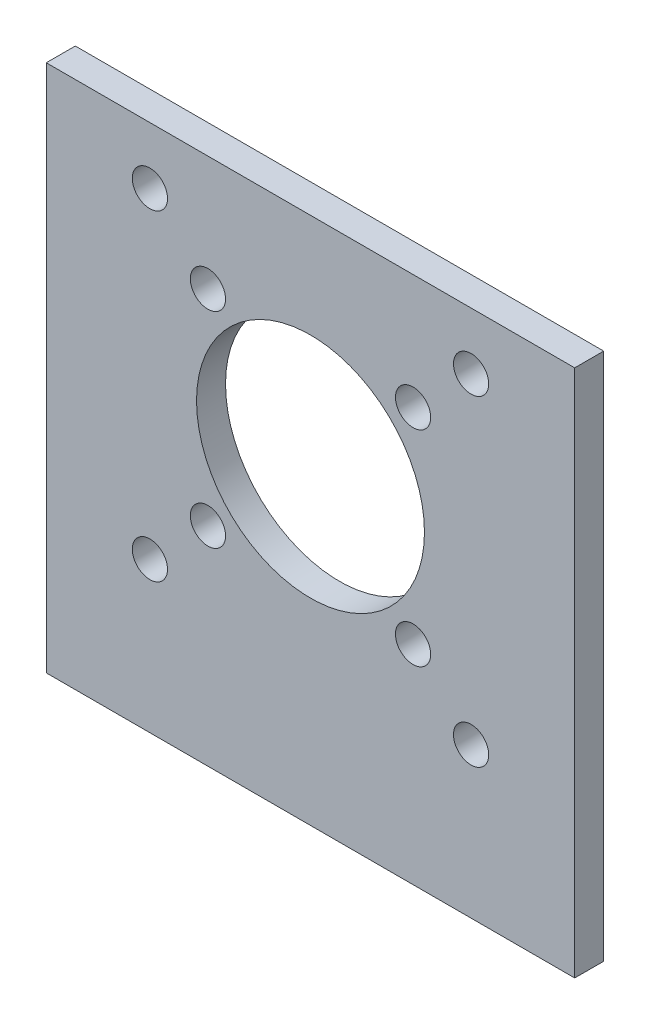
ISO-10303-21;
HEADER;
FILE_DESCRIPTION(('STEP AP214'),'2;1');
FILE_NAME('part.step','',(''),(''),'','','');
FILE_SCHEMA(('AUTOMOTIVE_DESIGN { 1 0 10303 214 1 1 1 1 }'));
ENDSEC;
DATA;
#1=APPLICATION_CONTEXT('core data for automotive mechanical design processes');
#2=APPLICATION_PROTOCOL_DEFINITION('international standard','automotive_design',2000,#1);
#3=PRODUCT_CONTEXT('',#1,'mechanical');
#4=PRODUCT('Part','Part','',(#3));
#5=PRODUCT_RELATED_PRODUCT_CATEGORY('part','',(#4));
#6=PRODUCT_DEFINITION_FORMATION('','',#4);
#7=PRODUCT_DEFINITION_CONTEXT('part definition',#1,'design');
#8=PRODUCT_DEFINITION('design','',#6,#7);
#9=PRODUCT_DEFINITION_SHAPE('','',#8);
#10=(LENGTH_UNIT() NAMED_UNIT(*) SI_UNIT(.MILLI.,.METRE.));
#11=(NAMED_UNIT(*) PLANE_ANGLE_UNIT() SI_UNIT($,.RADIAN.));
#12=(NAMED_UNIT(*) SI_UNIT($,.STERADIAN.) SOLID_ANGLE_UNIT());
#13=UNCERTAINTY_MEASURE_WITH_UNIT(LENGTH_MEASURE(1.E-05),#10,'distance_accuracy_value','');
#14=(GEOMETRIC_REPRESENTATION_CONTEXT(3) GLOBAL_UNCERTAINTY_ASSIGNED_CONTEXT((#13)) GLOBAL_UNIT_ASSIGNED_CONTEXT((#10,
#11,#12)) REPRESENTATION_CONTEXT('',''));
#15=CARTESIAN_POINT('',(0.,0.,0.));
#16=DIRECTION('',(0.,0.,1.));
#17=DIRECTION('',(1.,0.,0.));
#18=AXIS2_PLACEMENT_3D('',#15,#16,#17);
#19=CARTESIAN_POINT('',(25.5,25.5,2.8));
#20=DIRECTION('',(-1.,0.,0.));
#21=DIRECTION('',(0.,-1.,0.));
#22=AXIS2_PLACEMENT_3D('',#19,#20,#21);
#23=PLANE('',#22);
#24=DIRECTION('',(0.,1.,0.));
#25=VECTOR('',#24,1.);
#26=CARTESIAN_POINT('',(25.5,25.5,0.));
#27=LINE('',#26,#25);
#28=CARTESIAN_POINT('',(25.5,-25.5,0.));
#29=VERTEX_POINT('',#28);
#30=CARTESIAN_POINT('',(25.5,25.5,0.));
#31=VERTEX_POINT('',#30);
#32=EDGE_CURVE('E129',#29,#31,#27,.T.);
#33=ORIENTED_EDGE('',*,*,#32,.T.);
#34=DIRECTION('',(0.,0.,-1.));
#35=VECTOR('',#34,1.);
#36=CARTESIAN_POINT('',(25.5,25.5,2.8));
#37=LINE('',#36,#35);
#38=CARTESIAN_POINT('',(25.5,25.5,2.8));
#39=VERTEX_POINT('',#38);
#40=EDGE_CURVE('E12',#39,#31,#37,.T.);
#41=ORIENTED_EDGE('',*,*,#40,.F.);
#42=DIRECTION('',(0.,1.,0.));
#43=VECTOR('',#42,1.);
#44=CARTESIAN_POINT('',(25.5,25.5,2.8));
#45=LINE('',#44,#43);
#46=CARTESIAN_POINT('',(25.5,-25.5,2.8));
#47=VERTEX_POINT('',#46);
#48=EDGE_CURVE('E112',#47,#39,#45,.T.);
#49=ORIENTED_EDGE('',*,*,#48,.F.);
#50=DIRECTION('',(0.,0.,-1.));
#51=VECTOR('',#50,1.);
#52=CARTESIAN_POINT('',(25.5,-25.5,2.8));
#53=LINE('',#52,#51);
#54=EDGE_CURVE('E125',#47,#29,#53,.T.);
#55=ORIENTED_EDGE('',*,*,#54,.T.);
#56=EDGE_LOOP('',(#33,#41,#49,#55));
#57=FACE_BOUND('',#56,.T.);
#58=ADVANCED_FACE('F60',(#57),#23,.F.);
#59=CARTESIAN_POINT('',(-25.5,25.5,2.8));
#60=DIRECTION('',(0.,-1.,0.));
#61=DIRECTION('',(0.,0.,-1.));
#62=AXIS2_PLACEMENT_3D('',#59,#60,#61);
#63=PLANE('',#62);
#64=DIRECTION('',(-1.,0.,0.));
#65=VECTOR('',#64,1.);
#66=CARTESIAN_POINT('',(-25.5,25.5,0.));
#67=LINE('',#66,#65);
#68=CARTESIAN_POINT('',(-25.5,25.5,0.));
#69=VERTEX_POINT('',#68);
#70=EDGE_CURVE('E117',#31,#69,#67,.T.);
#71=ORIENTED_EDGE('',*,*,#70,.T.);
#72=DIRECTION('',(0.,0.,-1.));
#73=VECTOR('',#72,1.);
#74=CARTESIAN_POINT('',(-25.5,25.5,2.8));
#75=LINE('',#74,#73);
#76=CARTESIAN_POINT('',(-25.5,25.5,2.8));
#77=VERTEX_POINT('',#76);
#78=EDGE_CURVE('E69',#77,#69,#75,.T.);
#79=ORIENTED_EDGE('',*,*,#78,.F.);
#80=DIRECTION('',(-1.,0.,0.));
#81=VECTOR('',#80,1.);
#82=CARTESIAN_POINT('',(-25.5,25.5,2.8));
#83=LINE('',#82,#81);
#84=EDGE_CURVE('E107',#39,#77,#83,.T.);
#85=ORIENTED_EDGE('',*,*,#84,.F.);
#86=ORIENTED_EDGE('',*,*,#40,.T.);
#87=EDGE_LOOP('',(#71,#79,#85,#86));
#88=FACE_BOUND('',#87,.T.);
#89=ADVANCED_FACE('F116',(#88),#63,.F.);
#90=CARTESIAN_POINT('',(-25.5,25.5,2.8));
#91=DIRECTION('',(1.,0.,0.));
#92=DIRECTION('',(0.,1.,0.));
#93=AXIS2_PLACEMENT_3D('',#90,#91,#92);
#94=PLANE('',#93);
#95=DIRECTION('',(0.,-1.,0.));
#96=VECTOR('',#95,1.);
#97=CARTESIAN_POINT('',(-25.5,25.5,0.));
#98=LINE('',#97,#96);
#99=CARTESIAN_POINT('',(-25.5,-25.5,0.));
#100=VERTEX_POINT('',#99);
#101=EDGE_CURVE('E94',#69,#100,#98,.T.);
#102=ORIENTED_EDGE('',*,*,#101,.T.);
#103=DIRECTION('',(0.,0.,-1.));
#104=VECTOR('',#103,1.);
#105=CARTESIAN_POINT('',(-25.5,-25.5,2.8));
#106=LINE('',#105,#104);
#107=CARTESIAN_POINT('',(-25.5,-25.5,2.8));
#108=VERTEX_POINT('',#107);
#109=EDGE_CURVE('E119',#108,#100,#106,.T.);
#110=ORIENTED_EDGE('',*,*,#109,.F.);
#111=DIRECTION('',(0.,-1.,0.));
#112=VECTOR('',#111,1.);
#113=CARTESIAN_POINT('',(-25.5,25.5,2.8));
#114=LINE('',#113,#112);
#115=EDGE_CURVE('E110',#77,#108,#114,.T.);
#116=ORIENTED_EDGE('',*,*,#115,.F.);
#117=ORIENTED_EDGE('',*,*,#78,.T.);
#118=EDGE_LOOP('',(#102,#110,#116,#117));
#119=FACE_BOUND('',#118,.T.);
#120=ADVANCED_FACE('F120',(#119),#94,.F.);
#121=CARTESIAN_POINT('',(-25.5,-25.5,2.8));
#122=DIRECTION('',(0.,1.,0.));
#123=DIRECTION('',(0.,0.,1.));
#124=AXIS2_PLACEMENT_3D('',#121,#122,#123);
#125=PLANE('',#124);
#126=DIRECTION('',(1.,0.,0.));
#127=VECTOR('',#126,1.);
#128=CARTESIAN_POINT('',(-25.5,-25.5,0.));
#129=LINE('',#128,#127);
#130=EDGE_CURVE('E100',#100,#29,#129,.T.);
#131=ORIENTED_EDGE('',*,*,#130,.T.);
#132=ORIENTED_EDGE('',*,*,#54,.F.);
#133=DIRECTION('',(1.,0.,0.));
#134=VECTOR('',#133,1.);
#135=CARTESIAN_POINT('',(-25.5,-25.5,2.8));
#136=LINE('',#135,#134);
#137=EDGE_CURVE('E77',#108,#47,#136,.T.);
#138=ORIENTED_EDGE('',*,*,#137,.F.);
#139=ORIENTED_EDGE('',*,*,#109,.T.);
#140=EDGE_LOOP('',(#131,#132,#138,#139));
#141=FACE_BOUND('',#140,.T.);
#142=ADVANCED_FACE('F144',(#141),#125,.F.);
#143=CARTESIAN_POINT('',(0.,0.,2.8));
#144=DIRECTION('',(0.,0.,1.));
#145=DIRECTION('',(1.,0.,0.));
#146=AXIS2_PLACEMENT_3D('',#143,#144,#145);
#147=PLANE('',#146);
#148=CARTESIAN_POINT('',(15.5,20.,2.8));
#149=DIRECTION('',(0.,0.,-1.));
#150=DIRECTION('',(-1.,0.,0.));
#151=AXIS2_PLACEMENT_3D('',#148,#149,#150);
#152=CIRCLE('',#151,1.7);
#153=CARTESIAN_POINT('',(13.8,20.,2.8));
#154=VERTEX_POINT('',#153);
#155=EDGE_CURVE('E185',#154,#154,#152,.T.);
#156=ORIENTED_EDGE('',*,*,#155,.T.);
#157=EDGE_LOOP('',(#156));
#158=FACE_BOUND('',#157,.T.);
#159=CARTESIAN_POINT('',(15.5,-11.,2.8));
#160=DIRECTION('',(0.,0.,-1.));
#161=DIRECTION('',(-1.,0.,0.));
#162=AXIS2_PLACEMENT_3D('',#159,#160,#161);
#163=CIRCLE('',#162,1.7);
#164=CARTESIAN_POINT('',(13.8,-11.,2.8));
#165=VERTEX_POINT('',#164);
#166=EDGE_CURVE('E177',#165,#165,#163,.T.);
#167=ORIENTED_EDGE('',*,*,#166,.T.);
#168=EDGE_LOOP('',(#167));
#169=FACE_BOUND('',#168,.T.);
#170=CARTESIAN_POINT('',(-15.5,-11.,2.8));
#171=DIRECTION('',(0.,0.,-1.));
#172=DIRECTION('',(-1.,0.,0.));
#173=AXIS2_PLACEMENT_3D('',#170,#171,#172);
#174=CIRCLE('',#173,1.7);
#175=CARTESIAN_POINT('',(-17.2,-11.,2.8));
#176=VERTEX_POINT('',#175);
#177=EDGE_CURVE('E169',#176,#176,#174,.T.);
#178=ORIENTED_EDGE('',*,*,#177,.T.);
#179=EDGE_LOOP('',(#178));
#180=FACE_BOUND('',#179,.T.);
#181=CARTESIAN_POINT('',(-15.5,20.,2.8));
#182=DIRECTION('',(0.,0.,-1.));
#183=DIRECTION('',(-1.,0.,0.));
#184=AXIS2_PLACEMENT_3D('',#181,#182,#183);
#185=CIRCLE('',#184,1.7);
#186=CARTESIAN_POINT('',(-17.2,20.,2.8));
#187=VERTEX_POINT('',#186);
#188=EDGE_CURVE('E160',#187,#187,#185,.T.);
#189=ORIENTED_EDGE('',*,*,#188,.T.);
#190=EDGE_LOOP('',(#189));
#191=FACE_BOUND('',#190,.T.);
#192=CARTESIAN_POINT('',(-9.89949493661167,14.3994949366117,2.8));
#193=DIRECTION('',(0.,0.,-1.));
#194=DIRECTION('',(-1.,0.,0.));
#195=AXIS2_PLACEMENT_3D('',#192,#193,#194);
#196=CIRCLE('',#195,1.7);
#197=CARTESIAN_POINT('',(-11.5994949366117,14.3994949366117,2.8));
#198=VERTEX_POINT('',#197);
#199=EDGE_CURVE('E216',#198,#198,#196,.T.);
#200=ORIENTED_EDGE('',*,*,#199,.T.);
#201=EDGE_LOOP('',(#200));
#202=FACE_BOUND('',#201,.T.);
#203=CARTESIAN_POINT('',(9.89949493661167,14.3994949366117,2.8));
#204=DIRECTION('',(0.,0.,-1.));
#205=DIRECTION('',(-1.,0.,0.));
#206=AXIS2_PLACEMENT_3D('',#203,#204,#205);
#207=CIRCLE('',#206,1.7);
#208=CARTESIAN_POINT('',(8.19949493661167,14.3994949366117,2.8));
#209=VERTEX_POINT('',#208);
#210=EDGE_CURVE('E208',#209,#209,#207,.T.);
#211=ORIENTED_EDGE('',*,*,#210,.T.);
#212=EDGE_LOOP('',(#211));
#213=FACE_BOUND('',#212,.T.);
#214=CARTESIAN_POINT('',(-9.89949493661167,-5.39949493661168,2.8));
#215=DIRECTION('',(0.,0.,-1.));
#216=DIRECTION('',(-1.,0.,0.));
#217=AXIS2_PLACEMENT_3D('',#214,#215,#216);
#218=CIRCLE('',#217,1.7);
#219=CARTESIAN_POINT('',(-11.5994949366117,-5.39949493661168,2.8));
#220=VERTEX_POINT('',#219);
#221=EDGE_CURVE('E200',#220,#220,#218,.T.);
#222=ORIENTED_EDGE('',*,*,#221,.T.);
#223=EDGE_LOOP('',(#222));
#224=FACE_BOUND('',#223,.T.);
#225=CARTESIAN_POINT('',(9.89949493661166,-5.39949493661166,2.8));
#226=DIRECTION('',(0.,0.,-1.));
#227=DIRECTION('',(-1.,0.,0.));
#228=AXIS2_PLACEMENT_3D('',#225,#226,#227);
#229=CIRCLE('',#228,1.7);
#230=CARTESIAN_POINT('',(8.19949493661166,-5.39949493661166,2.8));
#231=VERTEX_POINT('',#230);
#232=EDGE_CURVE('E192',#231,#231,#229,.T.);
#233=ORIENTED_EDGE('',*,*,#232,.T.);
#234=EDGE_LOOP('',(#233));
#235=FACE_BOUND('',#234,.T.);
#236=CARTESIAN_POINT('',(0.,4.5,2.8));
#237=DIRECTION('',(0.,0.,-1.));
#238=DIRECTION('',(-1.,0.,0.));
#239=AXIS2_PLACEMENT_3D('',#236,#237,#238);
#240=CIRCLE('',#239,11.);
#241=CARTESIAN_POINT('',(-11.,4.5,2.8));
#242=VERTEX_POINT('',#241);
#243=EDGE_CURVE('E133',#242,#242,#240,.T.);
#244=ORIENTED_EDGE('',*,*,#243,.T.);
#245=EDGE_LOOP('',(#244));
#246=FACE_BOUND('',#245,.T.);
#247=ORIENTED_EDGE('',*,*,#48,.T.);
#248=ORIENTED_EDGE('',*,*,#84,.T.);
#249=ORIENTED_EDGE('',*,*,#115,.T.);
#250=ORIENTED_EDGE('',*,*,#137,.T.);
#251=EDGE_LOOP('',(#247,#248,#249,#250));
#252=FACE_BOUND('',#251,.T.);
#253=ADVANCED_FACE('F108',(#158,#169,#180,#191,#202,#213,#224,#235,#246,#252),#147,.T.);
#254=CARTESIAN_POINT('',(0.,0.,0.));
#255=DIRECTION('',(0.,0.,1.));
#256=DIRECTION('',(1.,0.,0.));
#257=AXIS2_PLACEMENT_3D('',#254,#255,#256);
#258=PLANE('',#257);
#259=CARTESIAN_POINT('',(15.5,20.,0.));
#260=DIRECTION('',(0.,0.,-1.));
#261=DIRECTION('',(-1.,0.,0.));
#262=AXIS2_PLACEMENT_3D('',#259,#260,#261);
#263=CIRCLE('',#262,1.7);
#264=CARTESIAN_POINT('',(13.8,20.,0.));
#265=VERTEX_POINT('',#264);
#266=EDGE_CURVE('E156',#265,#265,#263,.T.);
#267=ORIENTED_EDGE('',*,*,#266,.F.);
#268=EDGE_LOOP('',(#267));
#269=FACE_BOUND('',#268,.T.);
#270=CARTESIAN_POINT('',(15.5,-11.,0.));
#271=DIRECTION('',(0.,0.,-1.));
#272=DIRECTION('',(-1.,0.,0.));
#273=AXIS2_PLACEMENT_3D('',#270,#271,#272);
#274=CIRCLE('',#273,1.7);
#275=CARTESIAN_POINT('',(13.8,-11.,0.));
#276=VERTEX_POINT('',#275);
#277=EDGE_CURVE('E181',#276,#276,#274,.T.);
#278=ORIENTED_EDGE('',*,*,#277,.F.);
#279=EDGE_LOOP('',(#278));
#280=FACE_BOUND('',#279,.T.);
#281=CARTESIAN_POINT('',(-15.5,-11.,0.));
#282=DIRECTION('',(0.,0.,-1.));
#283=DIRECTION('',(-1.,0.,0.));
#284=AXIS2_PLACEMENT_3D('',#281,#282,#283);
#285=CIRCLE('',#284,1.7);
#286=CARTESIAN_POINT('',(-17.2,-11.,0.));
#287=VERTEX_POINT('',#286);
#288=EDGE_CURVE('E173',#287,#287,#285,.T.);
#289=ORIENTED_EDGE('',*,*,#288,.F.);
#290=EDGE_LOOP('',(#289));
#291=FACE_BOUND('',#290,.T.);
#292=CARTESIAN_POINT('',(-15.5,20.,0.));
#293=DIRECTION('',(0.,0.,-1.));
#294=DIRECTION('',(-1.,0.,0.));
#295=AXIS2_PLACEMENT_3D('',#292,#293,#294);
#296=CIRCLE('',#295,1.7);
#297=CARTESIAN_POINT('',(-17.2,20.,0.));
#298=VERTEX_POINT('',#297);
#299=EDGE_CURVE('E164',#298,#298,#296,.T.);
#300=ORIENTED_EDGE('',*,*,#299,.F.);
#301=EDGE_LOOP('',(#300));
#302=FACE_BOUND('',#301,.T.);
#303=CARTESIAN_POINT('',(-9.89949493661167,14.3994949366117,0.));
#304=DIRECTION('',(0.,0.,-1.));
#305=DIRECTION('',(-1.,0.,0.));
#306=AXIS2_PLACEMENT_3D('',#303,#304,#305);
#307=CIRCLE('',#306,1.7);
#308=CARTESIAN_POINT('',(-11.5994949366117,14.3994949366117,0.));
#309=VERTEX_POINT('',#308);
#310=EDGE_CURVE('E165',#309,#309,#307,.T.);
#311=ORIENTED_EDGE('',*,*,#310,.F.);
#312=EDGE_LOOP('',(#311));
#313=FACE_BOUND('',#312,.T.);
#314=CARTESIAN_POINT('',(9.89949493661167,14.3994949366117,0.));
#315=DIRECTION('',(0.,0.,-1.));
#316=DIRECTION('',(-1.,0.,0.));
#317=AXIS2_PLACEMENT_3D('',#314,#315,#316);
#318=CIRCLE('',#317,1.7);
#319=CARTESIAN_POINT('',(8.19949493661167,14.3994949366117,0.));
#320=VERTEX_POINT('',#319);
#321=EDGE_CURVE('E212',#320,#320,#318,.T.);
#322=ORIENTED_EDGE('',*,*,#321,.F.);
#323=EDGE_LOOP('',(#322));
#324=FACE_BOUND('',#323,.T.);
#325=CARTESIAN_POINT('',(-9.89949493661167,-5.39949493661168,0.));
#326=DIRECTION('',(0.,0.,-1.));
#327=DIRECTION('',(-1.,0.,0.));
#328=AXIS2_PLACEMENT_3D('',#325,#326,#327);
#329=CIRCLE('',#328,1.7);
#330=CARTESIAN_POINT('',(-11.5994949366117,-5.39949493661168,0.));
#331=VERTEX_POINT('',#330);
#332=EDGE_CURVE('E204',#331,#331,#329,.T.);
#333=ORIENTED_EDGE('',*,*,#332,.F.);
#334=EDGE_LOOP('',(#333));
#335=FACE_BOUND('',#334,.T.);
#336=CARTESIAN_POINT('',(9.89949493661166,-5.39949493661166,0.));
#337=DIRECTION('',(0.,0.,-1.));
#338=DIRECTION('',(-1.,0.,0.));
#339=AXIS2_PLACEMENT_3D('',#336,#337,#338);
#340=CIRCLE('',#339,1.7);
#341=CARTESIAN_POINT('',(8.19949493661166,-5.39949493661166,0.));
#342=VERTEX_POINT('',#341);
#343=EDGE_CURVE('E196',#342,#342,#340,.T.);
#344=ORIENTED_EDGE('',*,*,#343,.F.);
#345=EDGE_LOOP('',(#344));
#346=FACE_BOUND('',#345,.T.);
#347=CARTESIAN_POINT('',(0.,4.5,0.));
#348=DIRECTION('',(0.,0.,-1.));
#349=DIRECTION('',(-1.,0.,0.));
#350=AXIS2_PLACEMENT_3D('',#347,#348,#349);
#351=CIRCLE('',#350,11.);
#352=CARTESIAN_POINT('',(-11.,4.5,0.));
#353=VERTEX_POINT('',#352);
#354=EDGE_CURVE('E152',#353,#353,#351,.T.);
#355=ORIENTED_EDGE('',*,*,#354,.F.);
#356=EDGE_LOOP('',(#355));
#357=FACE_BOUND('',#356,.T.);
#358=ORIENTED_EDGE('',*,*,#32,.F.);
#359=ORIENTED_EDGE('',*,*,#130,.F.);
#360=ORIENTED_EDGE('',*,*,#101,.F.);
#361=ORIENTED_EDGE('',*,*,#70,.F.);
#362=EDGE_LOOP('',(#358,#359,#360,#361));
#363=FACE_BOUND('',#362,.T.);
#364=ADVANCED_FACE('F147',(#269,#280,#291,#302,#313,#324,#335,#346,#357,#363),#258,.F.);
#365=CARTESIAN_POINT('',(0.,4.5,2.8));
#366=DIRECTION('',(0.,0.,-1.));
#367=DIRECTION('',(-1.,0.,0.));
#368=AXIS2_PLACEMENT_3D('',#365,#366,#367);
#369=CYLINDRICAL_SURFACE('',#368,11.);
#370=ORIENTED_EDGE('',*,*,#243,.F.);
#371=EDGE_LOOP('',(#370));
#372=FACE_BOUND('',#371,.T.);
#373=ORIENTED_EDGE('',*,*,#354,.T.);
#374=EDGE_LOOP('',(#373));
#375=FACE_BOUND('',#374,.T.);
#376=ADVANCED_FACE('F229',(#372,#375),#369,.F.);
#377=CARTESIAN_POINT('',(9.89949493661166,-5.39949493661166,2.8));
#378=DIRECTION('',(0.,0.,-1.));
#379=DIRECTION('',(-1.,0.,0.));
#380=AXIS2_PLACEMENT_3D('',#377,#378,#379);
#381=CYLINDRICAL_SURFACE('',#380,1.7);
#382=ORIENTED_EDGE('',*,*,#232,.F.);
#383=EDGE_LOOP('',(#382));
#384=FACE_BOUND('',#383,.T.);
#385=ORIENTED_EDGE('',*,*,#343,.T.);
#386=EDGE_LOOP('',(#385));
#387=FACE_BOUND('',#386,.T.);
#388=ADVANCED_FACE('F241',(#384,#387),#381,.F.);
#389=CARTESIAN_POINT('',(-9.89949493661167,-5.39949493661168,2.8));
#390=DIRECTION('',(0.,0.,-1.));
#391=DIRECTION('',(-1.,0.,0.));
#392=AXIS2_PLACEMENT_3D('',#389,#390,#391);
#393=CYLINDRICAL_SURFACE('',#392,1.7);
#394=ORIENTED_EDGE('',*,*,#221,.F.);
#395=EDGE_LOOP('',(#394));
#396=FACE_BOUND('',#395,.T.);
#397=ORIENTED_EDGE('',*,*,#332,.T.);
#398=EDGE_LOOP('',(#397));
#399=FACE_BOUND('',#398,.T.);
#400=ADVANCED_FACE('F247',(#396,#399),#393,.F.);
#401=CARTESIAN_POINT('',(9.89949493661167,14.3994949366117,2.8));
#402=DIRECTION('',(0.,0.,-1.));
#403=DIRECTION('',(-1.,0.,0.));
#404=AXIS2_PLACEMENT_3D('',#401,#402,#403);
#405=CYLINDRICAL_SURFACE('',#404,1.7);
#406=ORIENTED_EDGE('',*,*,#210,.F.);
#407=EDGE_LOOP('',(#406));
#408=FACE_BOUND('',#407,.T.);
#409=ORIENTED_EDGE('',*,*,#321,.T.);
#410=EDGE_LOOP('',(#409));
#411=FACE_BOUND('',#410,.T.);
#412=ADVANCED_FACE('F287',(#408,#411),#405,.F.);
#413=CARTESIAN_POINT('',(-9.89949493661167,14.3994949366117,2.8));
#414=DIRECTION('',(0.,0.,-1.));
#415=DIRECTION('',(-1.,0.,0.));
#416=AXIS2_PLACEMENT_3D('',#413,#414,#415);
#417=CYLINDRICAL_SURFACE('',#416,1.7);
#418=ORIENTED_EDGE('',*,*,#199,.F.);
#419=EDGE_LOOP('',(#418));
#420=FACE_BOUND('',#419,.T.);
#421=ORIENTED_EDGE('',*,*,#310,.T.);
#422=EDGE_LOOP('',(#421));
#423=FACE_BOUND('',#422,.T.);
#424=ADVANCED_FACE('F225',(#420,#423),#417,.F.);
#425=CARTESIAN_POINT('',(-15.5,20.,2.8));
#426=DIRECTION('',(0.,0.,-1.));
#427=DIRECTION('',(-1.,0.,0.));
#428=AXIS2_PLACEMENT_3D('',#425,#426,#427);
#429=CYLINDRICAL_SURFACE('',#428,1.7);
#430=ORIENTED_EDGE('',*,*,#188,.F.);
#431=EDGE_LOOP('',(#430));
#432=FACE_BOUND('',#431,.T.);
#433=ORIENTED_EDGE('',*,*,#299,.T.);
#434=EDGE_LOOP('',(#433));
#435=FACE_BOUND('',#434,.T.);
#436=ADVANCED_FACE('F306',(#432,#435),#429,.F.);
#437=CARTESIAN_POINT('',(-15.5,-11.,2.8));
#438=DIRECTION('',(0.,0.,-1.));
#439=DIRECTION('',(-1.,0.,0.));
#440=AXIS2_PLACEMENT_3D('',#437,#438,#439);
#441=CYLINDRICAL_SURFACE('',#440,1.7);
#442=ORIENTED_EDGE('',*,*,#177,.F.);
#443=EDGE_LOOP('',(#442));
#444=FACE_BOUND('',#443,.T.);
#445=ORIENTED_EDGE('',*,*,#288,.T.);
#446=EDGE_LOOP('',(#445));
#447=FACE_BOUND('',#446,.T.);
#448=ADVANCED_FACE('F303',(#444,#447),#441,.F.);
#449=CARTESIAN_POINT('',(15.5,-11.,2.8));
#450=DIRECTION('',(0.,0.,-1.));
#451=DIRECTION('',(-1.,0.,0.));
#452=AXIS2_PLACEMENT_3D('',#449,#450,#451);
#453=CYLINDRICAL_SURFACE('',#452,1.7);
#454=ORIENTED_EDGE('',*,*,#166,.F.);
#455=EDGE_LOOP('',(#454));
#456=FACE_BOUND('',#455,.T.);
#457=ORIENTED_EDGE('',*,*,#277,.T.);
#458=EDGE_LOOP('',(#457));
#459=FACE_BOUND('',#458,.T.);
#460=ADVANCED_FACE('F299',(#456,#459),#453,.F.);
#461=CARTESIAN_POINT('',(15.5,20.,2.8));
#462=DIRECTION('',(0.,0.,-1.));
#463=DIRECTION('',(-1.,0.,0.));
#464=AXIS2_PLACEMENT_3D('',#461,#462,#463);
#465=CYLINDRICAL_SURFACE('',#464,1.7);
#466=ORIENTED_EDGE('',*,*,#155,.F.);
#467=EDGE_LOOP('',(#466));
#468=FACE_BOUND('',#467,.T.);
#469=ORIENTED_EDGE('',*,*,#266,.T.);
#470=EDGE_LOOP('',(#469));
#471=FACE_BOUND('',#470,.T.);
#472=ADVANCED_FACE('F296',(#468,#471),#465,.F.);
#473=CLOSED_SHELL('',(#58,#89,#120,#142,#253,#364,#376,#388,#400,#412,#424,#436,#448,#460,#472));
#474=MANIFOLD_SOLID_BREP('B2',#473);
#475=ADVANCED_BREP_SHAPE_REPRESENTATION('',(#18,#474),#14);
#476=SHAPE_DEFINITION_REPRESENTATION(#9,#475);
ENDSEC;
END-ISO-10303-21;
